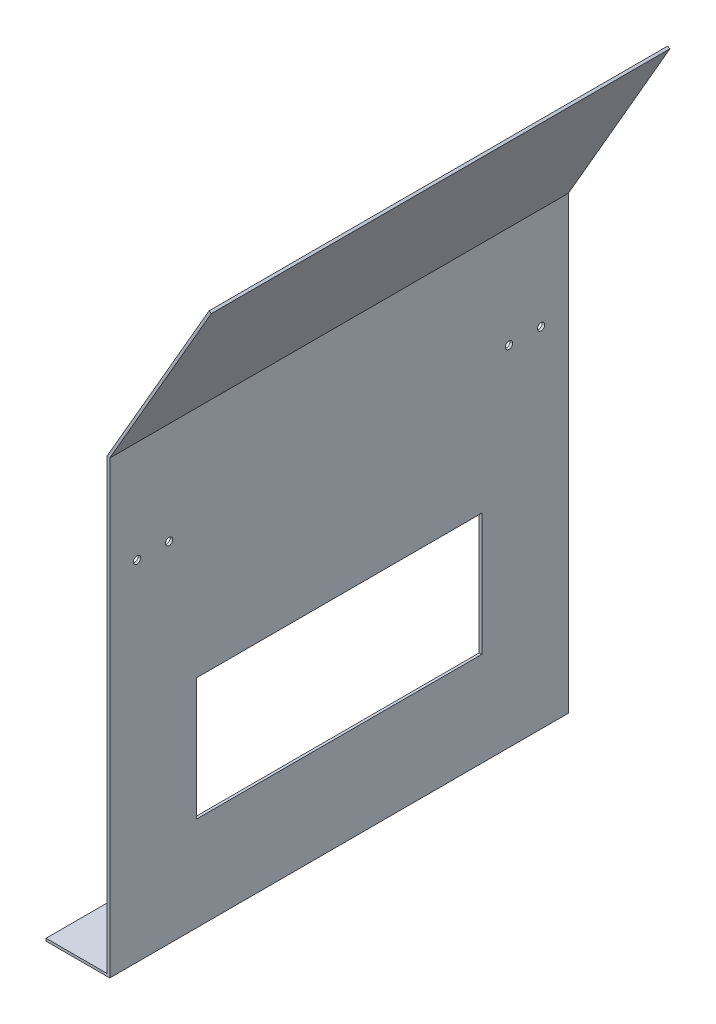
ISO-10303-21;
HEADER;
FILE_DESCRIPTION(('STEP AP214'),'2;1');
FILE_NAME('part.step','',(''),(''),'','','');
FILE_SCHEMA(('AUTOMOTIVE_DESIGN { 1 0 10303 214 1 1 1 1 }'));
ENDSEC;
DATA;
#1=APPLICATION_CONTEXT('core data for automotive mechanical design processes');
#2=APPLICATION_PROTOCOL_DEFINITION('international standard','automotive_design',2000,#1);
#3=PRODUCT_CONTEXT('',#1,'mechanical');
#4=PRODUCT('Part','Part','',(#3));
#5=PRODUCT_RELATED_PRODUCT_CATEGORY('part','',(#4));
#6=PRODUCT_DEFINITION_FORMATION('','',#4);
#7=PRODUCT_DEFINITION_CONTEXT('part definition',#1,'design');
#8=PRODUCT_DEFINITION('design','',#6,#7);
#9=PRODUCT_DEFINITION_SHAPE('','',#8);
#10=(LENGTH_UNIT() NAMED_UNIT(*) SI_UNIT(.MILLI.,.METRE.));
#11=(NAMED_UNIT(*) PLANE_ANGLE_UNIT() SI_UNIT($,.RADIAN.));
#12=(NAMED_UNIT(*) SI_UNIT($,.STERADIAN.) SOLID_ANGLE_UNIT());
#13=UNCERTAINTY_MEASURE_WITH_UNIT(LENGTH_MEASURE(1.E-05),#10,'distance_accuracy_value','');
#14=(GEOMETRIC_REPRESENTATION_CONTEXT(3) GLOBAL_UNCERTAINTY_ASSIGNED_CONTEXT((#13)) GLOBAL_UNIT_ASSIGNED_CONTEXT((#10,
#11,#12)) REPRESENTATION_CONTEXT('',''));
#15=CARTESIAN_POINT('',(0.,0.,0.));
#16=DIRECTION('',(0.,0.,1.));
#17=DIRECTION('',(1.,0.,0.));
#18=AXIS2_PLACEMENT_3D('',#15,#16,#17);
#19=CARTESIAN_POINT('',(0.,0.,285.75));
#20=DIRECTION('',(0.,-1.,0.));
#21=DIRECTION('',(1.,0.,0.));
#22=AXIS2_PLACEMENT_3D('',#19,#20,#21);
#23=PLANE('',#22);
#24=DIRECTION('',(-1.,0.,0.));
#25=VECTOR('',#24,1.);
#26=CARTESIAN_POINT('',(0.,0.,0.));
#27=LINE('',#26,#25);
#28=CARTESIAN_POINT('',(0.,0.,0.));
#29=VERTEX_POINT('',#28);
#30=CARTESIAN_POINT('',(-38.1,0.,0.));
#31=VERTEX_POINT('',#30);
#32=EDGE_CURVE('E147',#29,#31,#27,.T.);
#33=ORIENTED_EDGE('',*,*,#32,.T.);
#34=DIRECTION('',(0.,0.,-1.));
#35=VECTOR('',#34,1.);
#36=CARTESIAN_POINT('',(-38.1,0.,285.75));
#37=LINE('',#36,#35);
#38=CARTESIAN_POINT('',(-38.1,0.,285.75));
#39=VERTEX_POINT('',#38);
#40=EDGE_CURVE('E211',#39,#31,#37,.T.);
#41=ORIENTED_EDGE('',*,*,#40,.F.);
#42=DIRECTION('',(-1.,0.,0.));
#43=VECTOR('',#42,1.);
#44=CARTESIAN_POINT('',(0.,0.,285.75));
#45=LINE('',#44,#43);
#46=CARTESIAN_POINT('',(0.,0.,285.75));
#47=VERTEX_POINT('',#46);
#48=EDGE_CURVE('E150',#47,#39,#45,.T.);
#49=ORIENTED_EDGE('',*,*,#48,.F.);
#50=DIRECTION('',(0.,0.,-1.));
#51=VECTOR('',#50,1.);
#52=CARTESIAN_POINT('',(0.,0.,285.75));
#53=LINE('',#52,#51);
#54=EDGE_CURVE('E173',#47,#29,#53,.T.);
#55=ORIENTED_EDGE('',*,*,#54,.T.);
#56=EDGE_LOOP('',(#33,#41,#49,#55));
#57=FACE_BOUND('',#56,.T.);
#58=ADVANCED_FACE('F34',(#57),#23,.F.);
#59=CARTESIAN_POINT('',(-38.1,0.,285.75));
#60=DIRECTION('',(1.,0.,0.));
#61=DIRECTION('',(0.,0.,-1.));
#62=AXIS2_PLACEMENT_3D('',#59,#60,#61);
#63=PLANE('',#62);
#64=DIRECTION('',(0.,-1.,0.));
#65=VECTOR('',#64,1.);
#66=CARTESIAN_POINT('',(-38.1,0.,0.));
#67=LINE('',#66,#65);
#68=CARTESIAN_POINT('',(-38.1,-1.6002,0.));
#69=VERTEX_POINT('',#68);
#70=EDGE_CURVE('E176',#31,#69,#67,.T.);
#71=ORIENTED_EDGE('',*,*,#70,.T.);
#72=DIRECTION('',(0.,0.,-1.));
#73=VECTOR('',#72,1.);
#74=CARTESIAN_POINT('',(-38.1,-1.6002,285.75));
#75=LINE('',#74,#73);
#76=CARTESIAN_POINT('',(-38.1,-1.6002,285.75));
#77=VERTEX_POINT('',#76);
#78=EDGE_CURVE('E208',#77,#69,#75,.T.);
#79=ORIENTED_EDGE('',*,*,#78,.F.);
#80=DIRECTION('',(0.,-1.,0.));
#81=VECTOR('',#80,1.);
#82=CARTESIAN_POINT('',(-38.1,0.,285.75));
#83=LINE('',#82,#81);
#84=EDGE_CURVE('E153',#39,#77,#83,.T.);
#85=ORIENTED_EDGE('',*,*,#84,.F.);
#86=ORIENTED_EDGE('',*,*,#40,.T.);
#87=EDGE_LOOP('',(#71,#79,#85,#86));
#88=FACE_BOUND('',#87,.T.);
#89=ADVANCED_FACE('F280',(#88),#63,.F.);
#90=CARTESIAN_POINT('',(0.,-1.6002,285.75));
#91=DIRECTION('',(0.,1.,0.));
#92=DIRECTION('',(0.,0.,1.));
#93=AXIS2_PLACEMENT_3D('',#90,#91,#92);
#94=PLANE('',#93);
#95=DIRECTION('',(1.,0.,0.));
#96=VECTOR('',#95,1.);
#97=CARTESIAN_POINT('',(0.,-1.6002,0.));
#98=LINE('',#97,#96);
#99=CARTESIAN_POINT('',(1.6002,-1.6002,0.));
#100=VERTEX_POINT('',#99);
#101=EDGE_CURVE('E179',#69,#100,#98,.T.);
#102=ORIENTED_EDGE('',*,*,#101,.T.);
#103=DIRECTION('',(0.,0.,-1.));
#104=VECTOR('',#103,1.);
#105=CARTESIAN_POINT('',(1.6002,-1.6002,285.75));
#106=LINE('',#105,#104);
#107=CARTESIAN_POINT('',(1.6002,-1.6002,285.75));
#108=VERTEX_POINT('',#107);
#109=EDGE_CURVE('E205',#108,#100,#106,.T.);
#110=ORIENTED_EDGE('',*,*,#109,.F.);
#111=DIRECTION('',(-1.,0.,0.));
#112=VECTOR('',#111,1.);
#113=CARTESIAN_POINT('',(0.,-1.6002,285.75));
#114=LINE('',#113,#112);
#115=EDGE_CURVE('E156',#108,#77,#114,.T.);
#116=ORIENTED_EDGE('',*,*,#115,.T.);
#117=ORIENTED_EDGE('',*,*,#78,.T.);
#118=EDGE_LOOP('',(#102,#110,#116,#117));
#119=FACE_BOUND('',#118,.T.);
#120=ADVANCED_FACE('F256',(#119),#94,.F.);
#121=CARTESIAN_POINT('',(1.6002,0.,285.75));
#122=DIRECTION('',(-1.,0.,0.));
#123=DIRECTION('',(0.,0.,1.));
#124=AXIS2_PLACEMENT_3D('',#121,#122,#123);
#125=PLANE('',#124);
#126=CARTESIAN_POINT('',(1.6002,215.471227702272,36.987499939));
#127=DIRECTION('',(1.,0.,0.));
#128=DIRECTION('',(0.,0.,-1.));
#129=AXIS2_PLACEMENT_3D('',#126,#127,#128);
#130=CIRCLE('',#129,2.24789999999999);
#131=CARTESIAN_POINT('',(1.6002,215.471227702272,34.739599939));
#132=VERTEX_POINT('',#131);
#133=EDGE_CURVE('E242',#132,#132,#130,.T.);
#134=ORIENTED_EDGE('',*,*,#133,.F.);
#135=EDGE_LOOP('',(#134));
#136=FACE_BOUND('',#135,.T.);
#137=CARTESIAN_POINT('',(1.6002,215.471227702272,16.987500061));
#138=DIRECTION('',(1.,0.,0.));
#139=DIRECTION('',(0.,0.,-1.));
#140=AXIS2_PLACEMENT_3D('',#137,#138,#139);
#141=CIRCLE('',#140,2.2479);
#142=CARTESIAN_POINT('',(1.6002,215.471227702272,14.739600061));
#143=VERTEX_POINT('',#142);
#144=EDGE_CURVE('E236',#143,#143,#141,.T.);
#145=ORIENTED_EDGE('',*,*,#144,.F.);
#146=EDGE_LOOP('',(#145));
#147=FACE_BOUND('',#146,.T.);
#148=CARTESIAN_POINT('',(1.6002,215.471227702272,248.762500061));
#149=DIRECTION('',(1.,0.,0.));
#150=DIRECTION('',(0.,0.,-1.));
#151=AXIS2_PLACEMENT_3D('',#148,#149,#150);
#152=CIRCLE('',#151,2.2479);
#153=CARTESIAN_POINT('',(1.6002,215.471227702272,246.514600061));
#154=VERTEX_POINT('',#153);
#155=EDGE_CURVE('E231',#154,#154,#152,.T.);
#156=ORIENTED_EDGE('',*,*,#155,.F.);
#157=EDGE_LOOP('',(#156));
#158=FACE_BOUND('',#157,.T.);
#159=CARTESIAN_POINT('',(1.6002,215.471227702272,268.762499939));
#160=DIRECTION('',(1.,0.,0.));
#161=DIRECTION('',(0.,0.,-1.));
#162=AXIS2_PLACEMENT_3D('',#159,#160,#161);
#163=CIRCLE('',#162,2.24790000000001);
#164=CARTESIAN_POINT('',(1.6002,215.471227702272,266.514599939));
#165=VERTEX_POINT('',#164);
#166=EDGE_CURVE('E225',#165,#165,#163,.T.);
#167=ORIENTED_EDGE('',*,*,#166,.F.);
#168=EDGE_LOOP('',(#167));
#169=FACE_BOUND('',#168,.T.);
#170=DIRECTION('',(0.,0.,1.));
#171=VECTOR('',#170,1.);
#172=CARTESIAN_POINT('',(1.6002,133.35,231.775));
#173=LINE('',#172,#171);
#174=CARTESIAN_POINT('',(1.6002,133.35,53.975));
#175=VERTEX_POINT('',#174);
#176=CARTESIAN_POINT('',(1.6002,133.35,231.775));
#177=VERTEX_POINT('',#176);
#178=EDGE_CURVE('E133',#175,#177,#173,.T.);
#179=ORIENTED_EDGE('',*,*,#178,.F.);
#180=DIRECTION('',(0.,1.,0.));
#181=VECTOR('',#180,1.);
#182=CARTESIAN_POINT('',(1.6002,57.15,53.975));
#183=LINE('',#182,#181);
#184=CARTESIAN_POINT('',(1.6002,57.15,53.975));
#185=VERTEX_POINT('',#184);
#186=EDGE_CURVE('E48',#185,#175,#183,.T.);
#187=ORIENTED_EDGE('',*,*,#186,.F.);
#188=DIRECTION('',(0.,0.,-1.));
#189=VECTOR('',#188,1.);
#190=CARTESIAN_POINT('',(1.6002,57.15,231.775));
#191=LINE('',#190,#189);
#192=CARTESIAN_POINT('',(1.6002,57.15,231.775));
#193=VERTEX_POINT('',#192);
#194=EDGE_CURVE('E140',#193,#185,#191,.T.);
#195=ORIENTED_EDGE('',*,*,#194,.F.);
#196=DIRECTION('',(0.,-1.,0.));
#197=VECTOR('',#196,1.);
#198=CARTESIAN_POINT('',(1.6002,57.15,231.775));
#199=LINE('',#198,#197);
#200=EDGE_CURVE('E124',#177,#193,#199,.T.);
#201=ORIENTED_EDGE('',*,*,#200,.F.);
#202=EDGE_LOOP('',(#179,#187,#195,#201));
#203=FACE_BOUND('',#202,.T.);
#204=DIRECTION('',(0.,1.,0.));
#205=VECTOR('',#204,1.);
#206=CARTESIAN_POINT('',(1.6002,0.,0.));
#207=LINE('',#206,#205);
#208=CARTESIAN_POINT('',(1.6002,278.971227702272,0.));
#209=VERTEX_POINT('',#208);
#210=EDGE_CURVE('E182',#100,#209,#207,.T.);
#211=ORIENTED_EDGE('',*,*,#210,.T.);
#212=DIRECTION('',(0.,0.,-1.));
#213=VECTOR('',#212,1.);
#214=CARTESIAN_POINT('',(1.6002,278.971227702272,285.75));
#215=LINE('',#214,#213);
#216=CARTESIAN_POINT('',(1.6002,278.971227702272,285.75));
#217=VERTEX_POINT('',#216);
#218=EDGE_CURVE('E202',#217,#209,#215,.T.);
#219=ORIENTED_EDGE('',*,*,#218,.F.);
#220=DIRECTION('',(0.,-1.,0.));
#221=VECTOR('',#220,1.);
#222=CARTESIAN_POINT('',(1.6002,0.,285.75));
#223=LINE('',#222,#221);
#224=EDGE_CURVE('E159',#217,#108,#223,.T.);
#225=ORIENTED_EDGE('',*,*,#224,.T.);
#226=ORIENTED_EDGE('',*,*,#109,.T.);
#227=EDGE_LOOP('',(#211,#219,#225,#226));
#228=FACE_BOUND('',#227,.T.);
#229=ADVANCED_FACE('F137',(#136,#147,#158,#169,#203,#228),#125,.F.);
#230=CARTESIAN_POINT('',(1.6002,278.971227702272,285.75));
#231=DIRECTION('',(-0.866025403784439,0.5,0.));
#232=DIRECTION('',(-0.5,-0.866025403784439,0.));
#233=AXIS2_PLACEMENT_3D('',#230,#231,#232);
#234=PLANE('',#233);
#235=DIRECTION('',(0.5,0.866025403784439,0.));
#236=VECTOR('',#235,1.);
#237=CARTESIAN_POINT('',(1.6002,278.971227702272,0.));
#238=LINE('',#237,#236);
#239=CARTESIAN_POINT('',(64.8858138511358,388.585126280623,0.));
#240=VERTEX_POINT('',#239);
#241=EDGE_CURVE('E184',#209,#240,#238,.T.);
#242=ORIENTED_EDGE('',*,*,#241,.T.);
#243=DIRECTION('',(0.,0.,-1.));
#244=VECTOR('',#243,1.);
#245=CARTESIAN_POINT('',(64.8858138511358,388.585126280623,285.75));
#246=LINE('',#245,#244);
#247=CARTESIAN_POINT('',(64.8858138511358,388.585126280623,285.75));
#248=VERTEX_POINT('',#247);
#249=EDGE_CURVE('E200',#248,#240,#246,.T.);
#250=ORIENTED_EDGE('',*,*,#249,.F.);
#251=DIRECTION('',(0.5,0.866025403784439,0.));
#252=VECTOR('',#251,1.);
#253=CARTESIAN_POINT('',(1.6002,278.971227702272,285.75));
#254=LINE('',#253,#252);
#255=EDGE_CURVE('E162',#217,#248,#254,.T.);
#256=ORIENTED_EDGE('',*,*,#255,.F.);
#257=ORIENTED_EDGE('',*,*,#218,.T.);
#258=EDGE_LOOP('',(#242,#250,#256,#257));
#259=FACE_BOUND('',#258,.T.);
#260=ADVANCED_FACE('F255',(#259),#234,.F.);
#261=CARTESIAN_POINT('',(63.5,389.385226280623,285.75));
#262=DIRECTION('',(0.500000000000006,0.866025403784436,0.));
#263=DIRECTION('',(-0.866025403784435,0.500000000000006,0.));
#264=AXIS2_PLACEMENT_3D('',#261,#262,#263);
#265=PLANE('',#264);
#266=DIRECTION('',(0.866025403784435,-0.500000000000006,0.));
#267=VECTOR('',#266,1.);
#268=CARTESIAN_POINT('',(63.5,389.385226280623,0.));
#269=LINE('',#268,#267);
#270=CARTESIAN_POINT('',(63.5,389.385226280623,0.));
#271=VERTEX_POINT('',#270);
#272=EDGE_CURVE('E187',#271,#240,#269,.T.);
#273=ORIENTED_EDGE('',*,*,#272,.F.);
#274=DIRECTION('',(0.,0.,-1.));
#275=VECTOR('',#274,1.);
#276=CARTESIAN_POINT('',(63.5,389.385226280623,285.75));
#277=LINE('',#276,#275);
#278=CARTESIAN_POINT('',(63.5,389.385226280623,285.75));
#279=VERTEX_POINT('',#278);
#280=EDGE_CURVE('E198',#279,#271,#277,.T.);
#281=ORIENTED_EDGE('',*,*,#280,.F.);
#282=DIRECTION('',(0.866025403784435,-0.500000000000006,0.));
#283=VECTOR('',#282,1.);
#284=CARTESIAN_POINT('',(63.5,389.385226280623,285.75));
#285=LINE('',#284,#283);
#286=EDGE_CURVE('E164',#279,#248,#285,.T.);
#287=ORIENTED_EDGE('',*,*,#286,.T.);
#288=ORIENTED_EDGE('',*,*,#249,.T.);
#289=EDGE_LOOP('',(#273,#281,#287,#288));
#290=FACE_BOUND('',#289,.T.);
#291=ADVANCED_FACE('F300',(#290),#265,.T.);
#292=CARTESIAN_POINT('',(0.,279.4,285.75));
#293=DIRECTION('',(-0.866025403784438,0.500000000000001,0.));
#294=DIRECTION('',(-0.500000000000001,-0.866025403784438,0.));
#295=AXIS2_PLACEMENT_3D('',#292,#293,#294);
#296=PLANE('',#295);
#297=DIRECTION('',(0.500000000000001,0.866025403784438,0.));
#298=VECTOR('',#297,1.);
#299=CARTESIAN_POINT('',(0.,279.4,0.));
#300=LINE('',#299,#298);
#301=CARTESIAN_POINT('',(0.,279.4,0.));
#302=VERTEX_POINT('',#301);
#303=EDGE_CURVE('E190',#302,#271,#300,.T.);
#304=ORIENTED_EDGE('',*,*,#303,.F.);
#305=DIRECTION('',(0.,0.,-1.));
#306=VECTOR('',#305,1.);
#307=CARTESIAN_POINT('',(0.,279.4,285.75));
#308=LINE('',#307,#306);
#309=CARTESIAN_POINT('',(0.,279.4,285.75));
#310=VERTEX_POINT('',#309);
#311=EDGE_CURVE('E196',#310,#302,#308,.T.);
#312=ORIENTED_EDGE('',*,*,#311,.F.);
#313=DIRECTION('',(0.500000000000001,0.866025403784438,0.));
#314=VECTOR('',#313,1.);
#315=CARTESIAN_POINT('',(0.,279.4,285.75));
#316=LINE('',#315,#314);
#317=EDGE_CURVE('E167',#310,#279,#316,.T.);
#318=ORIENTED_EDGE('',*,*,#317,.T.);
#319=ORIENTED_EDGE('',*,*,#280,.T.);
#320=EDGE_LOOP('',(#304,#312,#318,#319));
#321=FACE_BOUND('',#320,.T.);
#322=ADVANCED_FACE('F296',(#321),#296,.T.);
#323=CARTESIAN_POINT('',(0.,0.,285.75));
#324=DIRECTION('',(-1.,0.,0.));
#325=DIRECTION('',(0.,0.,1.));
#326=AXIS2_PLACEMENT_3D('',#323,#324,#325);
#327=PLANE('',#326);
#328=CARTESIAN_POINT('',(0.,215.471227702272,36.987499939));
#329=DIRECTION('',(-1.,0.,0.));
#330=DIRECTION('',(0.,0.,1.));
#331=AXIS2_PLACEMENT_3D('',#328,#329,#330);
#332=CIRCLE('',#331,2.24789999999999);
#333=CARTESIAN_POINT('',(0.,215.471227702272,39.235399939));
#334=VERTEX_POINT('',#333);
#335=EDGE_CURVE('E245',#334,#334,#332,.F.);
#336=ORIENTED_EDGE('',*,*,#335,.T.);
#337=EDGE_LOOP('',(#336));
#338=FACE_BOUND('',#337,.T.);
#339=CARTESIAN_POINT('',(0.,215.471227702272,16.987500061));
#340=DIRECTION('',(-1.,0.,0.));
#341=DIRECTION('',(0.,0.,1.));
#342=AXIS2_PLACEMENT_3D('',#339,#340,#341);
#343=CIRCLE('',#342,2.2479);
#344=CARTESIAN_POINT('',(0.,215.471227702272,19.235400061));
#345=VERTEX_POINT('',#344);
#346=EDGE_CURVE('E239',#345,#345,#343,.F.);
#347=ORIENTED_EDGE('',*,*,#346,.T.);
#348=EDGE_LOOP('',(#347));
#349=FACE_BOUND('',#348,.T.);
#350=CARTESIAN_POINT('',(0.,215.471227702272,248.762500061));
#351=DIRECTION('',(-1.,0.,0.));
#352=DIRECTION('',(0.,0.,1.));
#353=AXIS2_PLACEMENT_3D('',#350,#351,#352);
#354=CIRCLE('',#353,2.2479);
#355=CARTESIAN_POINT('',(0.,215.471227702272,251.010400061));
#356=VERTEX_POINT('',#355);
#357=EDGE_CURVE('E233',#356,#356,#354,.F.);
#358=ORIENTED_EDGE('',*,*,#357,.T.);
#359=EDGE_LOOP('',(#358));
#360=FACE_BOUND('',#359,.T.);
#361=CARTESIAN_POINT('',(0.,215.471227702272,268.762499939));
#362=DIRECTION('',(-1.,0.,0.));
#363=DIRECTION('',(0.,0.,1.));
#364=AXIS2_PLACEMENT_3D('',#361,#362,#363);
#365=CIRCLE('',#364,2.24790000000001);
#366=CARTESIAN_POINT('',(0.,215.471227702272,271.010399939));
#367=VERTEX_POINT('',#366);
#368=EDGE_CURVE('E227',#367,#367,#365,.F.);
#369=ORIENTED_EDGE('',*,*,#368,.T.);
#370=EDGE_LOOP('',(#369));
#371=FACE_BOUND('',#370,.T.);
#372=DIRECTION('',(0.,-1.,0.));
#373=VECTOR('',#372,1.);
#374=CARTESIAN_POINT('',(0.,0.,53.975));
#375=LINE('',#374,#373);
#376=CARTESIAN_POINT('',(0.,133.35,53.975));
#377=VERTEX_POINT('',#376);
#378=CARTESIAN_POINT('',(0.,57.15,53.975));
#379=VERTEX_POINT('',#378);
#380=EDGE_CURVE('E11',#377,#379,#375,.T.);
#381=ORIENTED_EDGE('',*,*,#380,.F.);
#382=DIRECTION('',(0.,0.,-1.));
#383=VECTOR('',#382,1.);
#384=CARTESIAN_POINT('',(0.,133.35,285.75));
#385=LINE('',#384,#383);
#386=CARTESIAN_POINT('',(0.,133.35,231.775));
#387=VERTEX_POINT('',#386);
#388=EDGE_CURVE('E214',#387,#377,#385,.T.);
#389=ORIENTED_EDGE('',*,*,#388,.F.);
#390=DIRECTION('',(0.,1.,0.));
#391=VECTOR('',#390,1.);
#392=CARTESIAN_POINT('',(0.,0.,231.775));
#393=LINE('',#392,#391);
#394=CARTESIAN_POINT('',(0.,57.15,231.775));
#395=VERTEX_POINT('',#394);
#396=EDGE_CURVE('E127',#395,#387,#393,.T.);
#397=ORIENTED_EDGE('',*,*,#396,.F.);
#398=DIRECTION('',(0.,0.,1.));
#399=VECTOR('',#398,1.);
#400=CARTESIAN_POINT('',(0.,57.15,285.75));
#401=LINE('',#400,#399);
#402=EDGE_CURVE('E41',#379,#395,#401,.T.);
#403=ORIENTED_EDGE('',*,*,#402,.F.);
#404=EDGE_LOOP('',(#381,#389,#397,#403));
#405=FACE_BOUND('',#404,.T.);
#406=DIRECTION('',(0.,1.,0.));
#407=VECTOR('',#406,1.);
#408=CARTESIAN_POINT('',(0.,0.,0.));
#409=LINE('',#408,#407);
#410=EDGE_CURVE('E154',#29,#302,#409,.T.);
#411=ORIENTED_EDGE('',*,*,#410,.F.);
#412=ORIENTED_EDGE('',*,*,#54,.F.);
#413=DIRECTION('',(0.,1.,0.));
#414=VECTOR('',#413,1.);
#415=CARTESIAN_POINT('',(0.,0.,285.75));
#416=LINE('',#415,#414);
#417=EDGE_CURVE('E170',#47,#310,#416,.T.);
#418=ORIENTED_EDGE('',*,*,#417,.T.);
#419=ORIENTED_EDGE('',*,*,#311,.T.);
#420=EDGE_LOOP('',(#411,#412,#418,#419));
#421=FACE_BOUND('',#420,.T.);
#422=ADVANCED_FACE('F222',(#338,#349,#360,#371,#405,#421),#327,.T.);
#423=CARTESIAN_POINT('',(0.,0.,285.75));
#424=DIRECTION('',(0.,0.,1.));
#425=DIRECTION('',(1.,0.,0.));
#426=AXIS2_PLACEMENT_3D('',#423,#424,#425);
#427=PLANE('',#426);
#428=ORIENTED_EDGE('',*,*,#48,.T.);
#429=ORIENTED_EDGE('',*,*,#84,.T.);
#430=ORIENTED_EDGE('',*,*,#115,.F.);
#431=ORIENTED_EDGE('',*,*,#224,.F.);
#432=ORIENTED_EDGE('',*,*,#255,.T.);
#433=ORIENTED_EDGE('',*,*,#286,.F.);
#434=ORIENTED_EDGE('',*,*,#317,.F.);
#435=ORIENTED_EDGE('',*,*,#417,.F.);
#436=EDGE_LOOP('',(#428,#429,#430,#431,#432,#433,#434,#435));
#437=FACE_BOUND('',#436,.T.);
#438=ADVANCED_FACE('F310',(#437),#427,.T.);
#439=CARTESIAN_POINT('',(0.,0.,0.));
#440=DIRECTION('',(0.,0.,1.));
#441=DIRECTION('',(1.,0.,0.));
#442=AXIS2_PLACEMENT_3D('',#439,#440,#441);
#443=PLANE('',#442);
#444=ORIENTED_EDGE('',*,*,#32,.F.);
#445=ORIENTED_EDGE('',*,*,#410,.T.);
#446=ORIENTED_EDGE('',*,*,#303,.T.);
#447=ORIENTED_EDGE('',*,*,#272,.T.);
#448=ORIENTED_EDGE('',*,*,#241,.F.);
#449=ORIENTED_EDGE('',*,*,#210,.F.);
#450=ORIENTED_EDGE('',*,*,#101,.F.);
#451=ORIENTED_EDGE('',*,*,#70,.F.);
#452=EDGE_LOOP('',(#444,#445,#446,#447,#448,#449,#450,#451));
#453=FACE_BOUND('',#452,.T.);
#454=ADVANCED_FACE('F291',(#453),#443,.F.);
#455=CARTESIAN_POINT('',(-38.1,57.15,53.975));
#456=DIRECTION('',(0.,0.,-1.));
#457=DIRECTION('',(-1.,0.,0.));
#458=AXIS2_PLACEMENT_3D('',#455,#456,#457);
#459=PLANE('',#458);
#460=ORIENTED_EDGE('',*,*,#380,.T.);
#461=DIRECTION('',(1.,0.,0.));
#462=VECTOR('',#461,1.);
#463=CARTESIAN_POINT('',(-38.1,57.15,53.975));
#464=LINE('',#463,#462);
#465=EDGE_CURVE('E145',#379,#185,#464,.T.);
#466=ORIENTED_EDGE('',*,*,#465,.T.);
#467=ORIENTED_EDGE('',*,*,#186,.T.);
#468=DIRECTION('',(1.,0.,0.));
#469=VECTOR('',#468,1.);
#470=CARTESIAN_POINT('',(-38.1,133.35,53.975));
#471=LINE('',#470,#469);
#472=EDGE_CURVE('E130',#377,#175,#471,.T.);
#473=ORIENTED_EDGE('',*,*,#472,.F.);
#474=EDGE_LOOP('',(#460,#466,#467,#473));
#475=FACE_BOUND('',#474,.T.);
#476=ADVANCED_FACE('F224',(#475),#459,.F.);
#477=CARTESIAN_POINT('',(-38.1,57.15,231.775));
#478=DIRECTION('',(0.,-1.,0.));
#479=DIRECTION('',(0.,0.,-1.));
#480=AXIS2_PLACEMENT_3D('',#477,#478,#479);
#481=PLANE('',#480);
#482=ORIENTED_EDGE('',*,*,#402,.T.);
#483=DIRECTION('',(1.,0.,0.));
#484=VECTOR('',#483,1.);
#485=CARTESIAN_POINT('',(-38.1,57.15,231.775));
#486=LINE('',#485,#484);
#487=EDGE_CURVE('E129',#395,#193,#486,.T.);
#488=ORIENTED_EDGE('',*,*,#487,.T.);
#489=ORIENTED_EDGE('',*,*,#194,.T.);
#490=ORIENTED_EDGE('',*,*,#465,.F.);
#491=EDGE_LOOP('',(#482,#488,#489,#490));
#492=FACE_BOUND('',#491,.T.);
#493=ADVANCED_FACE('F219',(#492),#481,.F.);
#494=CARTESIAN_POINT('',(-38.1,57.15,231.775));
#495=DIRECTION('',(0.,0.,1.));
#496=DIRECTION('',(1.,0.,0.));
#497=AXIS2_PLACEMENT_3D('',#494,#495,#496);
#498=PLANE('',#497);
#499=ORIENTED_EDGE('',*,*,#396,.T.);
#500=DIRECTION('',(1.,0.,0.));
#501=VECTOR('',#500,1.);
#502=CARTESIAN_POINT('',(-38.1,133.35,231.775));
#503=LINE('',#502,#501);
#504=EDGE_CURVE('E56',#387,#177,#503,.T.);
#505=ORIENTED_EDGE('',*,*,#504,.T.);
#506=ORIENTED_EDGE('',*,*,#200,.T.);
#507=ORIENTED_EDGE('',*,*,#487,.F.);
#508=EDGE_LOOP('',(#499,#505,#506,#507));
#509=FACE_BOUND('',#508,.T.);
#510=ADVANCED_FACE('F121',(#509),#498,.F.);
#511=CARTESIAN_POINT('',(-38.1,133.35,231.775));
#512=DIRECTION('',(0.,1.,0.));
#513=DIRECTION('',(0.,0.,1.));
#514=AXIS2_PLACEMENT_3D('',#511,#512,#513);
#515=PLANE('',#514);
#516=ORIENTED_EDGE('',*,*,#388,.T.);
#517=ORIENTED_EDGE('',*,*,#472,.T.);
#518=ORIENTED_EDGE('',*,*,#178,.T.);
#519=ORIENTED_EDGE('',*,*,#504,.F.);
#520=EDGE_LOOP('',(#516,#517,#518,#519));
#521=FACE_BOUND('',#520,.T.);
#522=ADVANCED_FACE('F134',(#521),#515,.F.);
#523=CARTESIAN_POINT('',(-38.101,215.471227702272,268.762499939));
#524=DIRECTION('',(1.,0.,0.));
#525=DIRECTION('',(0.,0.,-1.));
#526=AXIS2_PLACEMENT_3D('',#523,#524,#525);
#527=CYLINDRICAL_SURFACE('',#526,2.24790000000001);
#528=ORIENTED_EDGE('',*,*,#368,.F.);
#529=EDGE_LOOP('',(#528));
#530=FACE_BOUND('',#529,.T.);
#531=ORIENTED_EDGE('',*,*,#166,.T.);
#532=EDGE_LOOP('',(#531));
#533=FACE_BOUND('',#532,.T.);
#534=ADVANCED_FACE('F264',(#530,#533),#527,.F.);
#535=CARTESIAN_POINT('',(-38.101,215.471227702272,248.762500061));
#536=DIRECTION('',(1.,0.,0.));
#537=DIRECTION('',(0.,0.,-1.));
#538=AXIS2_PLACEMENT_3D('',#535,#536,#537);
#539=CYLINDRICAL_SURFACE('',#538,2.2479);
#540=ORIENTED_EDGE('',*,*,#357,.F.);
#541=EDGE_LOOP('',(#540));
#542=FACE_BOUND('',#541,.T.);
#543=ORIENTED_EDGE('',*,*,#155,.T.);
#544=EDGE_LOOP('',(#543));
#545=FACE_BOUND('',#544,.T.);
#546=ADVANCED_FACE('F266',(#542,#545),#539,.F.);
#547=CARTESIAN_POINT('',(-38.101,215.471227702272,16.987500061));
#548=DIRECTION('',(1.,0.,0.));
#549=DIRECTION('',(0.,0.,-1.));
#550=AXIS2_PLACEMENT_3D('',#547,#548,#549);
#551=CYLINDRICAL_SURFACE('',#550,2.2479);
#552=ORIENTED_EDGE('',*,*,#346,.F.);
#553=EDGE_LOOP('',(#552));
#554=FACE_BOUND('',#553,.T.);
#555=ORIENTED_EDGE('',*,*,#144,.T.);
#556=EDGE_LOOP('',(#555));
#557=FACE_BOUND('',#556,.T.);
#558=ADVANCED_FACE('F273',(#554,#557),#551,.F.);
#559=CARTESIAN_POINT('',(-38.101,215.471227702272,36.987499939));
#560=DIRECTION('',(1.,0.,0.));
#561=DIRECTION('',(0.,0.,-1.));
#562=AXIS2_PLACEMENT_3D('',#559,#560,#561);
#563=CYLINDRICAL_SURFACE('',#562,2.24789999999999);
#564=ORIENTED_EDGE('',*,*,#335,.F.);
#565=EDGE_LOOP('',(#564));
#566=FACE_BOUND('',#565,.T.);
#567=ORIENTED_EDGE('',*,*,#133,.T.);
#568=EDGE_LOOP('',(#567));
#569=FACE_BOUND('',#568,.T.);
#570=ADVANCED_FACE('F251',(#566,#569),#563,.F.);
#571=CLOSED_SHELL('',(#58,#89,#120,#229,#260,#291,#322,#422,#438,#454,#476,#493,#510,#522,#534,
#546,#558,#570));
#572=MANIFOLD_SOLID_BREP('B2',#571);
#573=ADVANCED_BREP_SHAPE_REPRESENTATION('',(#18,#572),#14);
#574=SHAPE_DEFINITION_REPRESENTATION(#9,#573);
ENDSEC;
END-ISO-10303-21;
